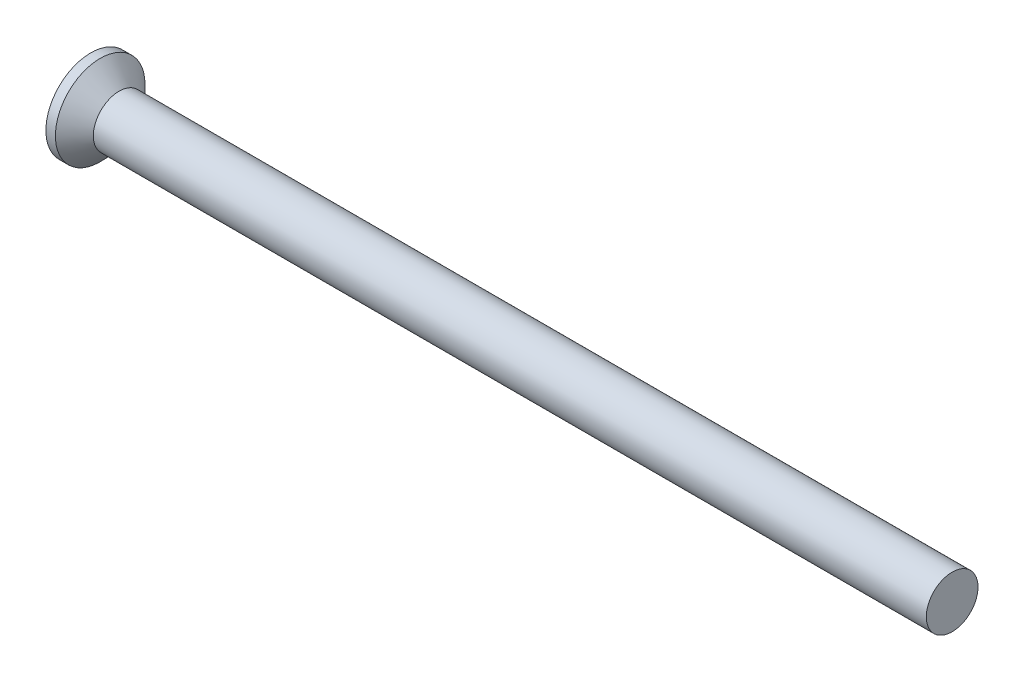
ISO-10303-21;
HEADER;
FILE_DESCRIPTION(('STEP AP214'),'2;1');
FILE_NAME('part.step','',(''),(''),'','','');
FILE_SCHEMA(('AUTOMOTIVE_DESIGN { 1 0 10303 214 1 1 1 1 }'));
ENDSEC;
DATA;
#1=APPLICATION_CONTEXT('core data for automotive mechanical design processes');
#2=APPLICATION_PROTOCOL_DEFINITION('international standard','automotive_design',2000,#1);
#3=PRODUCT_CONTEXT('',#1,'mechanical');
#4=PRODUCT('Part','Part','',(#3));
#5=PRODUCT_RELATED_PRODUCT_CATEGORY('part','',(#4));
#6=PRODUCT_DEFINITION_FORMATION('','',#4);
#7=PRODUCT_DEFINITION_CONTEXT('part definition',#1,'design');
#8=PRODUCT_DEFINITION('design','',#6,#7);
#9=PRODUCT_DEFINITION_SHAPE('','',#8);
#10=(LENGTH_UNIT() NAMED_UNIT(*) SI_UNIT(.MILLI.,.METRE.));
#11=(NAMED_UNIT(*) PLANE_ANGLE_UNIT() SI_UNIT($,.RADIAN.));
#12=(NAMED_UNIT(*) SI_UNIT($,.STERADIAN.) SOLID_ANGLE_UNIT());
#13=UNCERTAINTY_MEASURE_WITH_UNIT(LENGTH_MEASURE(1.E-05),#10,'distance_accuracy_value','');
#14=(GEOMETRIC_REPRESENTATION_CONTEXT(3) GLOBAL_UNCERTAINTY_ASSIGNED_CONTEXT((#13)) GLOBAL_UNIT_ASSIGNED_CONTEXT((#10,
#11,#12)) REPRESENTATION_CONTEXT('',''));
#15=CARTESIAN_POINT('',(0.,0.,0.));
#16=DIRECTION('',(0.,0.,1.));
#17=DIRECTION('',(1.,0.,0.));
#18=AXIS2_PLACEMENT_3D('',#15,#16,#17);
#19=CARTESIAN_POINT('',(0.,2.6,0.));
#20=DIRECTION('',(-1.,0.,0.));
#21=DIRECTION('',(0.,0.,1.));
#22=AXIS2_PLACEMENT_3D('',#19,#20,#21);
#23=PLANE('',#22);
#24=CARTESIAN_POINT('',(0.,0.,0.));
#25=DIRECTION('',(1.,0.,0.));
#26=DIRECTION('',(0.,0.,-1.));
#27=AXIS2_PLACEMENT_3D('',#24,#25,#26);
#28=CIRCLE('',#27,2.6);
#29=CARTESIAN_POINT('',(0.,0.,-2.6));
#30=VERTEX_POINT('',#29);
#31=EDGE_CURVE('E183',#30,#30,#28,.T.);
#32=ORIENTED_EDGE('',*,*,#31,.F.);
#33=EDGE_LOOP('',(#32));
#34=FACE_BOUND('',#33,.T.);
#35=DIRECTION('',(0.,1.,0.));
#36=VECTOR('',#35,1.);
#37=CARTESIAN_POINT('',(0.,-0.32,-0.32));
#38=LINE('',#37,#36);
#39=CARTESIAN_POINT('',(0.,-1.6,-0.32));
#40=VERTEX_POINT('',#39);
#41=CARTESIAN_POINT('',(0.,-0.62,-0.32));
#42=VERTEX_POINT('',#41);
#43=EDGE_CURVE('E287',#40,#42,#38,.T.);
#44=ORIENTED_EDGE('',*,*,#43,.T.);
#45=CARTESIAN_POINT('',(0.,-0.62,-0.62));
#46=DIRECTION('',(-1.,0.,0.));
#47=DIRECTION('',(0.,0.,1.));
#48=AXIS2_PLACEMENT_3D('',#45,#46,#47);
#49=CIRCLE('',#48,0.3);
#50=CARTESIAN_POINT('',(0.,-0.32,-0.62));
#51=VERTEX_POINT('',#50);
#52=EDGE_CURVE('E189',#42,#51,#49,.T.);
#53=ORIENTED_EDGE('',*,*,#52,.T.);
#54=DIRECTION('',(0.,0.,-1.));
#55=VECTOR('',#54,1.);
#56=CARTESIAN_POINT('',(0.,-0.32,-0.32));
#57=LINE('',#56,#55);
#58=CARTESIAN_POINT('',(0.,-0.32,-1.6));
#59=VERTEX_POINT('',#58);
#60=EDGE_CURVE('E282',#51,#59,#57,.T.);
#61=ORIENTED_EDGE('',*,*,#60,.T.);
#62=DIRECTION('',(0.,1.,0.));
#63=VECTOR('',#62,1.);
#64=CARTESIAN_POINT('',(0.,0.32,-1.6));
#65=LINE('',#64,#63);
#66=CARTESIAN_POINT('',(0.,0.32,-1.6));
#67=VERTEX_POINT('',#66);
#68=EDGE_CURVE('E246',#59,#67,#65,.T.);
#69=ORIENTED_EDGE('',*,*,#68,.T.);
#70=DIRECTION('',(0.,0.,1.));
#71=VECTOR('',#70,1.);
#72=CARTESIAN_POINT('',(0.,0.32,-0.32));
#73=LINE('',#72,#71);
#74=CARTESIAN_POINT('',(0.,0.32,-0.62));
#75=VERTEX_POINT('',#74);
#76=EDGE_CURVE('E236',#67,#75,#73,.T.);
#77=ORIENTED_EDGE('',*,*,#76,.T.);
#78=CARTESIAN_POINT('',(0.,0.62,-0.62));
#79=DIRECTION('',(-1.,0.,0.));
#80=DIRECTION('',(0.,0.,1.));
#81=AXIS2_PLACEMENT_3D('',#78,#79,#80);
#82=CIRCLE('',#81,0.3);
#83=CARTESIAN_POINT('',(0.,0.62,-0.32));
#84=VERTEX_POINT('',#83);
#85=EDGE_CURVE('E185',#75,#84,#82,.T.);
#86=ORIENTED_EDGE('',*,*,#85,.T.);
#87=DIRECTION('',(0.,1.,0.));
#88=VECTOR('',#87,1.);
#89=CARTESIAN_POINT('',(0.,0.32,-0.32));
#90=LINE('',#89,#88);
#91=CARTESIAN_POINT('',(0.,1.6,-0.32));
#92=VERTEX_POINT('',#91);
#93=EDGE_CURVE('E233',#84,#92,#90,.T.);
#94=ORIENTED_EDGE('',*,*,#93,.T.);
#95=DIRECTION('',(0.,0.,1.));
#96=VECTOR('',#95,1.);
#97=CARTESIAN_POINT('',(0.,1.6,-0.32));
#98=LINE('',#97,#96);
#99=CARTESIAN_POINT('',(0.,1.6,0.32));
#100=VERTEX_POINT('',#99);
#101=EDGE_CURVE('E242',#92,#100,#98,.T.);
#102=ORIENTED_EDGE('',*,*,#101,.T.);
#103=DIRECTION('',(0.,-1.,0.));
#104=VECTOR('',#103,1.);
#105=CARTESIAN_POINT('',(0.,0.32,0.32));
#106=LINE('',#105,#104);
#107=CARTESIAN_POINT('',(0.,0.62,0.32));
#108=VERTEX_POINT('',#107);
#109=EDGE_CURVE('E244',#100,#108,#106,.T.);
#110=ORIENTED_EDGE('',*,*,#109,.T.);
#111=CARTESIAN_POINT('',(0.,0.62,0.62));
#112=DIRECTION('',(-1.,0.,0.));
#113=DIRECTION('',(0.,0.,1.));
#114=AXIS2_PLACEMENT_3D('',#111,#112,#113);
#115=CIRCLE('',#114,0.3);
#116=CARTESIAN_POINT('',(0.,0.32,0.62));
#117=VERTEX_POINT('',#116);
#118=EDGE_CURVE('E155',#108,#117,#115,.T.);
#119=ORIENTED_EDGE('',*,*,#118,.T.);
#120=DIRECTION('',(0.,0.,1.));
#121=VECTOR('',#120,1.);
#122=CARTESIAN_POINT('',(0.,0.32,0.32));
#123=LINE('',#122,#121);
#124=CARTESIAN_POINT('',(0.,0.32,1.6));
#125=VERTEX_POINT('',#124);
#126=EDGE_CURVE('E149',#117,#125,#123,.T.);
#127=ORIENTED_EDGE('',*,*,#126,.T.);
#128=DIRECTION('',(0.,-1.,0.));
#129=VECTOR('',#128,1.);
#130=CARTESIAN_POINT('',(0.,0.32,1.6));
#131=LINE('',#130,#129);
#132=CARTESIAN_POINT('',(0.,-0.32,1.6));
#133=VERTEX_POINT('',#132);
#134=EDGE_CURVE('E153',#125,#133,#131,.T.);
#135=ORIENTED_EDGE('',*,*,#134,.T.);
#136=DIRECTION('',(0.,0.,-1.));
#137=VECTOR('',#136,1.);
#138=CARTESIAN_POINT('',(0.,-0.32,0.32));
#139=LINE('',#138,#137);
#140=CARTESIAN_POINT('',(0.,-0.32,0.62));
#141=VERTEX_POINT('',#140);
#142=EDGE_CURVE('E165',#133,#141,#139,.T.);
#143=ORIENTED_EDGE('',*,*,#142,.T.);
#144=CARTESIAN_POINT('',(0.,-0.62,0.62));
#145=DIRECTION('',(-1.,0.,0.));
#146=DIRECTION('',(0.,0.,1.));
#147=AXIS2_PLACEMENT_3D('',#144,#145,#146);
#148=CIRCLE('',#147,0.3);
#149=CARTESIAN_POINT('',(0.,-0.62,0.32));
#150=VERTEX_POINT('',#149);
#151=EDGE_CURVE('E187',#141,#150,#148,.T.);
#152=ORIENTED_EDGE('',*,*,#151,.T.);
#153=DIRECTION('',(0.,-1.,0.));
#154=VECTOR('',#153,1.);
#155=CARTESIAN_POINT('',(0.,-0.32,0.32));
#156=LINE('',#155,#154);
#157=CARTESIAN_POINT('',(0.,-1.6,0.319999999999999));
#158=VERTEX_POINT('',#157);
#159=EDGE_CURVE('E294',#150,#158,#156,.T.);
#160=ORIENTED_EDGE('',*,*,#159,.T.);
#161=DIRECTION('',(0.,0.,-1.));
#162=VECTOR('',#161,1.);
#163=CARTESIAN_POINT('',(0.,-1.6,-0.32));
#164=LINE('',#163,#162);
#165=EDGE_CURVE('E291',#158,#40,#164,.T.);
#166=ORIENTED_EDGE('',*,*,#165,.T.);
#167=EDGE_LOOP('',(#44,#53,#61,#69,#77,#86,#94,#102,#110,#119,#127,#135,#143,#152,#160,#166));
#168=FACE_BOUND('',#167,.T.);
#169=ADVANCED_FACE('F37',(#34,#168),#23,.T.);
#170=CARTESIAN_POINT('',(50.,1.50000000000001,0.));
#171=DIRECTION('',(1.,0.,0.));
#172=DIRECTION('',(0.,0.,-1.));
#173=AXIS2_PLACEMENT_3D('',#170,#171,#172);
#174=PLANE('',#173);
#175=CARTESIAN_POINT('',(50.,0.,0.));
#176=DIRECTION('',(1.,0.,0.));
#177=DIRECTION('',(0.,0.,-1.));
#178=AXIS2_PLACEMENT_3D('',#175,#176,#177);
#179=CIRCLE('',#178,1.50000000000001);
#180=CARTESIAN_POINT('',(50.,0.,-1.50000000000001));
#181=VERTEX_POINT('',#180);
#182=EDGE_CURVE('E170',#181,#181,#179,.T.);
#183=ORIENTED_EDGE('',*,*,#182,.T.);
#184=EDGE_LOOP('',(#183));
#185=FACE_BOUND('',#184,.T.);
#186=ADVANCED_FACE('F343',(#185),#174,.T.);
#187=CARTESIAN_POINT('',(4.51581291088132,0.,0.));
#188=DIRECTION('',(1.,0.,0.));
#189=DIRECTION('',(0.,0.,-1.));
#190=AXIS2_PLACEMENT_3D('',#187,#188,#189);
#191=CYLINDRICAL_SURFACE('',#190,2.6);
#192=ORIENTED_EDGE('',*,*,#31,.T.);
#193=EDGE_LOOP('',(#192));
#194=FACE_BOUND('',#193,.T.);
#195=CARTESIAN_POINT('',(0.550000000000004,0.,0.));
#196=DIRECTION('',(1.,0.,0.));
#197=DIRECTION('',(0.,0.,-1.));
#198=AXIS2_PLACEMENT_3D('',#195,#196,#197);
#199=CIRCLE('',#198,2.6);
#200=CARTESIAN_POINT('',(0.550000000000004,0.,-2.6));
#201=VERTEX_POINT('',#200);
#202=EDGE_CURVE('E253',#201,#201,#199,.T.);
#203=ORIENTED_EDGE('',*,*,#202,.F.);
#204=EDGE_LOOP('',(#203));
#205=FACE_BOUND('',#204,.T.);
#206=ADVANCED_FACE('F349',(#194,#205),#191,.T.);
#207=CARTESIAN_POINT('',(1.65,0.,0.));
#208=DIRECTION('',(-1.,0.,0.));
#209=DIRECTION('',(0.,0.,1.));
#210=AXIS2_PLACEMENT_3D('',#207,#208,#209);
#211=CONICAL_SURFACE('',#210,1.5,0.78539816339745);
#212=ORIENTED_EDGE('',*,*,#202,.T.);
#213=EDGE_LOOP('',(#212));
#214=FACE_BOUND('',#213,.T.);
#215=CARTESIAN_POINT('',(1.65,0.,0.));
#216=DIRECTION('',(1.,0.,0.));
#217=DIRECTION('',(0.,0.,-1.));
#218=AXIS2_PLACEMENT_3D('',#215,#216,#217);
#219=CIRCLE('',#218,1.5);
#220=CARTESIAN_POINT('',(1.65,0.,-1.5));
#221=VERTEX_POINT('',#220);
#222=EDGE_CURVE('E173',#221,#221,#219,.T.);
#223=ORIENTED_EDGE('',*,*,#222,.F.);
#224=EDGE_LOOP('',(#223));
#225=FACE_BOUND('',#224,.T.);
#226=ADVANCED_FACE('F489',(#214,#225),#211,.T.);
#227=CARTESIAN_POINT('',(4.51581291088132,0.,0.));
#228=DIRECTION('',(1.,0.,0.));
#229=DIRECTION('',(0.,0.,-1.));
#230=AXIS2_PLACEMENT_3D('',#227,#228,#229);
#231=CYLINDRICAL_SURFACE('',#230,1.5);
#232=ORIENTED_EDGE('',*,*,#182,.F.);
#233=EDGE_LOOP('',(#232));
#234=FACE_BOUND('',#233,.T.);
#235=ORIENTED_EDGE('',*,*,#222,.T.);
#236=EDGE_LOOP('',(#235));
#237=FACE_BOUND('',#236,.T.);
#238=ADVANCED_FACE('F459',(#234,#237),#231,.T.);
#239=CARTESIAN_POINT('',(0.825,0.32,0.32));
#240=DIRECTION('',(0.,-1.,0.));
#241=DIRECTION('',(0.,0.,-1.));
#242=AXIS2_PLACEMENT_3D('',#239,#240,#241);
#243=PLANE('',#242);
#244=ORIENTED_EDGE('',*,*,#126,.F.);
#245=DIRECTION('',(-1.,0.,0.));
#246=VECTOR('',#245,1.);
#247=CARTESIAN_POINT('',(0.825,0.32,0.62));
#248=LINE('',#247,#246);
#249=CARTESIAN_POINT('',(0.825,0.32,0.62));
#250=VERTEX_POINT('',#249);
#251=EDGE_CURVE('E52',#117,#250,#248,.F.);
#252=ORIENTED_EDGE('',*,*,#251,.T.);
#253=DIRECTION('',(0.,0.,1.));
#254=VECTOR('',#253,1.);
#255=CARTESIAN_POINT('',(0.825,0.32,0.32));
#256=LINE('',#255,#254);
#257=CARTESIAN_POINT('',(0.825,0.32,1.12368602791856));
#258=VERTEX_POINT('',#257);
#259=EDGE_CURVE('E168',#250,#258,#256,.T.);
#260=ORIENTED_EDGE('',*,*,#259,.T.);
#261=DIRECTION('',(-0.866025403784438,0.,0.500000000000001));
#262=VECTOR('',#261,1.);
#263=CARTESIAN_POINT('',(0.,0.32,1.6));
#264=LINE('',#263,#262);
#265=EDGE_CURVE('E161',#258,#125,#264,.T.);
#266=ORIENTED_EDGE('',*,*,#265,.T.);
#267=EDGE_LOOP('',(#244,#252,#260,#266));
#268=FACE_BOUND('',#267,.T.);
#269=ADVANCED_FACE('F167',(#268),#243,.T.);
#270=CARTESIAN_POINT('',(0.,0.32,1.6));
#271=DIRECTION('',(-0.500000000000001,0.,-0.866025403784438));
#272=DIRECTION('',(-0.866025403784438,0.,0.500000000000001));
#273=AXIS2_PLACEMENT_3D('',#270,#271,#272);
#274=PLANE('',#273);
#275=ORIENTED_EDGE('',*,*,#134,.F.);
#276=ORIENTED_EDGE('',*,*,#265,.F.);
#277=DIRECTION('',(0.,-1.,0.));
#278=VECTOR('',#277,1.);
#279=CARTESIAN_POINT('',(0.825,0.32,1.12368602791856));
#280=LINE('',#279,#278);
#281=CARTESIAN_POINT('',(0.825,-0.32,1.12368602791856));
#282=VERTEX_POINT('',#281);
#283=EDGE_CURVE('E179',#258,#282,#280,.T.);
#284=ORIENTED_EDGE('',*,*,#283,.T.);
#285=DIRECTION('',(-0.866025403784438,0.,0.500000000000001));
#286=VECTOR('',#285,1.);
#287=CARTESIAN_POINT('',(1.17300625842204,-0.32,0.922764520938917));
#288=LINE('',#287,#286);
#289=EDGE_CURVE('E163',#282,#133,#288,.T.);
#290=ORIENTED_EDGE('',*,*,#289,.T.);
#291=EDGE_LOOP('',(#275,#276,#284,#290));
#292=FACE_BOUND('',#291,.T.);
#293=ADVANCED_FACE('F160',(#292),#274,.T.);
#294=CARTESIAN_POINT('',(0.825,-0.32,0.32));
#295=DIRECTION('',(0.,1.,0.));
#296=DIRECTION('',(0.,0.,1.));
#297=AXIS2_PLACEMENT_3D('',#294,#295,#296);
#298=PLANE('',#297);
#299=DIRECTION('',(0.,0.,-1.));
#300=VECTOR('',#299,1.);
#301=CARTESIAN_POINT('',(0.825,-0.32,0.32));
#302=LINE('',#301,#300);
#303=CARTESIAN_POINT('',(0.825,-0.32,0.62));
#304=VERTEX_POINT('',#303);
#305=EDGE_CURVE('E303',#282,#304,#302,.T.);
#306=ORIENTED_EDGE('',*,*,#305,.T.);
#307=DIRECTION('',(-1.,0.,0.));
#308=VECTOR('',#307,1.);
#309=CARTESIAN_POINT('',(0.825,-0.32,0.62));
#310=LINE('',#309,#308);
#311=EDGE_CURVE('E193',#304,#141,#310,.T.);
#312=ORIENTED_EDGE('',*,*,#311,.T.);
#313=ORIENTED_EDGE('',*,*,#142,.F.);
#314=ORIENTED_EDGE('',*,*,#289,.F.);
#315=EDGE_LOOP('',(#306,#312,#313,#314));
#316=FACE_BOUND('',#315,.T.);
#317=ADVANCED_FACE('F308',(#316),#298,.T.);
#318=CARTESIAN_POINT('',(0.825,-0.32,0.32));
#319=DIRECTION('',(0.,0.,-1.));
#320=DIRECTION('',(0.,1.,0.));
#321=AXIS2_PLACEMENT_3D('',#318,#319,#320);
#322=PLANE('',#321);
#323=ORIENTED_EDGE('',*,*,#159,.F.);
#324=DIRECTION('',(-1.,0.,0.));
#325=VECTOR('',#324,1.);
#326=CARTESIAN_POINT('',(0.825,-0.62,0.32));
#327=LINE('',#326,#325);
#328=CARTESIAN_POINT('',(0.825,-0.62,0.32));
#329=VERTEX_POINT('',#328);
#330=EDGE_CURVE('E196',#150,#329,#327,.F.);
#331=ORIENTED_EDGE('',*,*,#330,.T.);
#332=DIRECTION('',(0.,-1.,0.));
#333=VECTOR('',#332,1.);
#334=CARTESIAN_POINT('',(0.825,-0.32,0.32));
#335=LINE('',#334,#333);
#336=CARTESIAN_POINT('',(0.825,-1.12368602791856,0.32));
#337=VERTEX_POINT('',#336);
#338=EDGE_CURVE('E264',#329,#337,#335,.T.);
#339=ORIENTED_EDGE('',*,*,#338,.T.);
#340=DIRECTION('',(-0.866025403784438,-0.500000000000001,0.));
#341=VECTOR('',#340,1.);
#342=CARTESIAN_POINT('',(0.,-1.6,0.319999999999999));
#343=LINE('',#342,#341);
#344=EDGE_CURVE('E175',#337,#158,#343,.T.);
#345=ORIENTED_EDGE('',*,*,#344,.T.);
#346=EDGE_LOOP('',(#323,#331,#339,#345));
#347=FACE_BOUND('',#346,.T.);
#348=ADVANCED_FACE('F318',(#347),#322,.T.);
#349=CARTESIAN_POINT('',(0.,-1.6,-0.32));
#350=DIRECTION('',(-0.500000000000001,0.866025403784438,0.));
#351=DIRECTION('',(-0.866025403784438,-0.500000000000001,0.));
#352=AXIS2_PLACEMENT_3D('',#349,#350,#351);
#353=PLANE('',#352);
#354=ORIENTED_EDGE('',*,*,#165,.F.);
#355=ORIENTED_EDGE('',*,*,#344,.F.);
#356=DIRECTION('',(0.,0.,-1.));
#357=VECTOR('',#356,1.);
#358=CARTESIAN_POINT('',(0.825,-1.12368602791856,-0.32));
#359=LINE('',#358,#357);
#360=CARTESIAN_POINT('',(0.825,-1.12368602791856,-0.32));
#361=VERTEX_POINT('',#360);
#362=EDGE_CURVE('E261',#337,#361,#359,.T.);
#363=ORIENTED_EDGE('',*,*,#362,.T.);
#364=DIRECTION('',(-0.866025403784438,-0.500000000000001,0.));
#365=VECTOR('',#364,1.);
#366=CARTESIAN_POINT('',(1.17300625842204,-0.922764520938918,-0.32));
#367=LINE('',#366,#365);
#368=EDGE_CURVE('E258',#361,#40,#367,.T.);
#369=ORIENTED_EDGE('',*,*,#368,.T.);
#370=EDGE_LOOP('',(#354,#355,#363,#369));
#371=FACE_BOUND('',#370,.T.);
#372=ADVANCED_FACE('F322',(#371),#353,.T.);
#373=CARTESIAN_POINT('',(0.825,-0.32,-0.32));
#374=DIRECTION('',(0.,0.,1.));
#375=DIRECTION('',(1.,0.,0.));
#376=AXIS2_PLACEMENT_3D('',#373,#374,#375);
#377=PLANE('',#376);
#378=DIRECTION('',(0.,1.,0.));
#379=VECTOR('',#378,1.);
#380=CARTESIAN_POINT('',(0.825,-0.32,-0.32));
#381=LINE('',#380,#379);
#382=CARTESIAN_POINT('',(0.825,-0.62,-0.32));
#383=VERTEX_POINT('',#382);
#384=EDGE_CURVE('E263',#361,#383,#381,.T.);
#385=ORIENTED_EDGE('',*,*,#384,.T.);
#386=DIRECTION('',(-1.,0.,0.));
#387=VECTOR('',#386,1.);
#388=CARTESIAN_POINT('',(0.825,-0.62,-0.32));
#389=LINE('',#388,#387);
#390=EDGE_CURVE('E180',#383,#42,#389,.T.);
#391=ORIENTED_EDGE('',*,*,#390,.T.);
#392=ORIENTED_EDGE('',*,*,#43,.F.);
#393=ORIENTED_EDGE('',*,*,#368,.F.);
#394=EDGE_LOOP('',(#385,#391,#392,#393));
#395=FACE_BOUND('',#394,.T.);
#396=ADVANCED_FACE('F326',(#395),#377,.T.);
#397=CARTESIAN_POINT('',(0.825,-0.32,-0.32));
#398=DIRECTION('',(0.,1.,0.));
#399=DIRECTION('',(0.,0.,1.));
#400=AXIS2_PLACEMENT_3D('',#397,#398,#399);
#401=PLANE('',#400);
#402=ORIENTED_EDGE('',*,*,#60,.F.);
#403=DIRECTION('',(-1.,0.,0.));
#404=VECTOR('',#403,1.);
#405=CARTESIAN_POINT('',(0.825,-0.32,-0.62));
#406=LINE('',#405,#404);
#407=CARTESIAN_POINT('',(0.825,-0.32,-0.62));
#408=VERTEX_POINT('',#407);
#409=EDGE_CURVE('E191',#51,#408,#406,.F.);
#410=ORIENTED_EDGE('',*,*,#409,.T.);
#411=DIRECTION('',(0.,0.,-1.));
#412=VECTOR('',#411,1.);
#413=CARTESIAN_POINT('',(0.825,-0.32,-0.32));
#414=LINE('',#413,#412);
#415=CARTESIAN_POINT('',(0.825,-0.32,-1.12368602791856));
#416=VERTEX_POINT('',#415);
#417=EDGE_CURVE('E275',#408,#416,#414,.T.);
#418=ORIENTED_EDGE('',*,*,#417,.T.);
#419=DIRECTION('',(-0.866025403784438,0.,-0.500000000000001));
#420=VECTOR('',#419,1.);
#421=CARTESIAN_POINT('',(0.,-0.32,-1.6));
#422=LINE('',#421,#420);
#423=EDGE_CURVE('E260',#416,#59,#422,.T.);
#424=ORIENTED_EDGE('',*,*,#423,.T.);
#425=EDGE_LOOP('',(#402,#410,#418,#424));
#426=FACE_BOUND('',#425,.T.);
#427=ADVANCED_FACE('F281',(#426),#401,.T.);
#428=CARTESIAN_POINT('',(0.,0.32,-1.6));
#429=DIRECTION('',(-0.500000000000001,0.,0.866025403784438));
#430=DIRECTION('',(0.866025403784438,0.,0.500000000000001));
#431=AXIS2_PLACEMENT_3D('',#428,#429,#430);
#432=PLANE('',#431);
#433=ORIENTED_EDGE('',*,*,#68,.F.);
#434=ORIENTED_EDGE('',*,*,#423,.F.);
#435=DIRECTION('',(0.,1.,0.));
#436=VECTOR('',#435,1.);
#437=CARTESIAN_POINT('',(0.825,0.32,-1.12368602791856));
#438=LINE('',#437,#436);
#439=CARTESIAN_POINT('',(0.825,0.32,-1.12368602791856));
#440=VERTEX_POINT('',#439);
#441=EDGE_CURVE('E228',#416,#440,#438,.T.);
#442=ORIENTED_EDGE('',*,*,#441,.T.);
#443=DIRECTION('',(-0.866025403784438,0.,-0.500000000000001));
#444=VECTOR('',#443,1.);
#445=CARTESIAN_POINT('',(1.17300625842204,0.32,-0.922764520938918));
#446=LINE('',#445,#444);
#447=EDGE_CURVE('E227',#440,#67,#446,.T.);
#448=ORIENTED_EDGE('',*,*,#447,.T.);
#449=EDGE_LOOP('',(#433,#434,#442,#448));
#450=FACE_BOUND('',#449,.T.);
#451=ADVANCED_FACE('F286',(#450),#432,.T.);
#452=CARTESIAN_POINT('',(0.825,0.32,-0.32));
#453=DIRECTION('',(0.,-1.,0.));
#454=DIRECTION('',(0.,0.,-1.));
#455=AXIS2_PLACEMENT_3D('',#452,#453,#454);
#456=PLANE('',#455);
#457=DIRECTION('',(0.,0.,1.));
#458=VECTOR('',#457,1.);
#459=CARTESIAN_POINT('',(0.825,0.32,-0.32));
#460=LINE('',#459,#458);
#461=CARTESIAN_POINT('',(0.825,0.32,-0.62));
#462=VERTEX_POINT('',#461);
#463=EDGE_CURVE('E216',#440,#462,#460,.T.);
#464=ORIENTED_EDGE('',*,*,#463,.T.);
#465=DIRECTION('',(-1.,0.,0.));
#466=VECTOR('',#465,1.);
#467=CARTESIAN_POINT('',(0.825,0.32,-0.62));
#468=LINE('',#467,#466);
#469=EDGE_CURVE('E198',#462,#75,#468,.T.);
#470=ORIENTED_EDGE('',*,*,#469,.T.);
#471=ORIENTED_EDGE('',*,*,#76,.F.);
#472=ORIENTED_EDGE('',*,*,#447,.F.);
#473=EDGE_LOOP('',(#464,#470,#471,#472));
#474=FACE_BOUND('',#473,.T.);
#475=ADVANCED_FACE('F224',(#474),#456,.T.);
#476=CARTESIAN_POINT('',(0.825,0.32,-0.32));
#477=DIRECTION('',(0.,0.,1.));
#478=DIRECTION('',(1.,0.,0.));
#479=AXIS2_PLACEMENT_3D('',#476,#477,#478);
#480=PLANE('',#479);
#481=ORIENTED_EDGE('',*,*,#93,.F.);
#482=DIRECTION('',(-1.,0.,0.));
#483=VECTOR('',#482,1.);
#484=CARTESIAN_POINT('',(0.825,0.62,-0.32));
#485=LINE('',#484,#483);
#486=CARTESIAN_POINT('',(0.825,0.62,-0.32));
#487=VERTEX_POINT('',#486);
#488=EDGE_CURVE('E201',#84,#487,#485,.F.);
#489=ORIENTED_EDGE('',*,*,#488,.T.);
#490=DIRECTION('',(0.,1.,0.));
#491=VECTOR('',#490,1.);
#492=CARTESIAN_POINT('',(0.825,0.32,-0.32));
#493=LINE('',#492,#491);
#494=CARTESIAN_POINT('',(0.825,1.12368602791856,-0.32));
#495=VERTEX_POINT('',#494);
#496=EDGE_CURVE('E218',#487,#495,#493,.T.);
#497=ORIENTED_EDGE('',*,*,#496,.T.);
#498=DIRECTION('',(-0.866025403784438,0.500000000000001,0.));
#499=VECTOR('',#498,1.);
#500=CARTESIAN_POINT('',(0.,1.6,-0.32));
#501=LINE('',#500,#499);
#502=EDGE_CURVE('E240',#495,#92,#501,.T.);
#503=ORIENTED_EDGE('',*,*,#502,.T.);
#504=EDGE_LOOP('',(#481,#489,#497,#503));
#505=FACE_BOUND('',#504,.T.);
#506=ADVANCED_FACE('F238',(#505),#480,.T.);
#507=CARTESIAN_POINT('',(0.,1.6,-0.32));
#508=DIRECTION('',(-0.500000000000001,-0.866025403784438,0.));
#509=DIRECTION('',(0.866025403784438,-0.500000000000001,0.));
#510=AXIS2_PLACEMENT_3D('',#507,#508,#509);
#511=PLANE('',#510);
#512=ORIENTED_EDGE('',*,*,#101,.F.);
#513=ORIENTED_EDGE('',*,*,#502,.F.);
#514=DIRECTION('',(0.,0.,1.));
#515=VECTOR('',#514,1.);
#516=CARTESIAN_POINT('',(0.825,1.12368602791856,-0.32));
#517=LINE('',#516,#515);
#518=CARTESIAN_POINT('',(0.825,1.12368602791856,0.32));
#519=VERTEX_POINT('',#518);
#520=EDGE_CURVE('E270',#495,#519,#517,.T.);
#521=ORIENTED_EDGE('',*,*,#520,.T.);
#522=DIRECTION('',(-0.866025403784438,0.500000000000001,0.));
#523=VECTOR('',#522,1.);
#524=CARTESIAN_POINT('',(1.17300625842204,0.922764520938918,0.32));
#525=LINE('',#524,#523);
#526=EDGE_CURVE('E267',#519,#100,#525,.T.);
#527=ORIENTED_EDGE('',*,*,#526,.T.);
#528=EDGE_LOOP('',(#512,#513,#521,#527));
#529=FACE_BOUND('',#528,.T.);
#530=ADVANCED_FACE('F361',(#529),#511,.T.);
#531=CARTESIAN_POINT('',(0.825,0.32,0.32));
#532=DIRECTION('',(0.,0.,-1.));
#533=DIRECTION('',(0.,1.,0.));
#534=AXIS2_PLACEMENT_3D('',#531,#532,#533);
#535=PLANE('',#534);
#536=DIRECTION('',(0.,-1.,0.));
#537=VECTOR('',#536,1.);
#538=CARTESIAN_POINT('',(0.825,0.32,0.32));
#539=LINE('',#538,#537);
#540=CARTESIAN_POINT('',(0.825,0.62,0.32));
#541=VERTEX_POINT('',#540);
#542=EDGE_CURVE('E269',#519,#541,#539,.T.);
#543=ORIENTED_EDGE('',*,*,#542,.T.);
#544=DIRECTION('',(-1.,0.,0.));
#545=VECTOR('',#544,1.);
#546=CARTESIAN_POINT('',(0.825,0.62,0.32));
#547=LINE('',#546,#545);
#548=EDGE_CURVE('E203',#541,#108,#547,.T.);
#549=ORIENTED_EDGE('',*,*,#548,.T.);
#550=ORIENTED_EDGE('',*,*,#109,.F.);
#551=ORIENTED_EDGE('',*,*,#526,.F.);
#552=EDGE_LOOP('',(#543,#549,#550,#551));
#553=FACE_BOUND('',#552,.T.);
#554=ADVANCED_FACE('F339',(#553),#535,.T.);
#555=CARTESIAN_POINT('',(0.825,0.32,0.32));
#556=DIRECTION('',(1.,0.,0.));
#557=DIRECTION('',(0.,0.,-1.));
#558=AXIS2_PLACEMENT_3D('',#555,#556,#557);
#559=PLANE('',#558);
#560=ORIENTED_EDGE('',*,*,#259,.F.);
#561=CARTESIAN_POINT('',(0.825,0.62,0.62));
#562=DIRECTION('',(1.,0.,0.));
#563=DIRECTION('',(0.,0.,-1.));
#564=AXIS2_PLACEMENT_3D('',#561,#562,#563);
#565=CIRCLE('',#564,0.3);
#566=EDGE_CURVE('E11',#250,#541,#565,.T.);
#567=ORIENTED_EDGE('',*,*,#566,.T.);
#568=ORIENTED_EDGE('',*,*,#542,.F.);
#569=ORIENTED_EDGE('',*,*,#520,.F.);
#570=ORIENTED_EDGE('',*,*,#496,.F.);
#571=CARTESIAN_POINT('',(0.825,0.62,-0.62));
#572=DIRECTION('',(1.,0.,0.));
#573=DIRECTION('',(0.,0.,-1.));
#574=AXIS2_PLACEMENT_3D('',#571,#572,#573);
#575=CIRCLE('',#574,0.3);
#576=EDGE_CURVE('E45',#487,#462,#575,.T.);
#577=ORIENTED_EDGE('',*,*,#576,.T.);
#578=ORIENTED_EDGE('',*,*,#463,.F.);
#579=ORIENTED_EDGE('',*,*,#441,.F.);
#580=ORIENTED_EDGE('',*,*,#417,.F.);
#581=CARTESIAN_POINT('',(0.825,-0.62,-0.62));
#582=DIRECTION('',(1.,0.,0.));
#583=DIRECTION('',(0.,0.,-1.));
#584=AXIS2_PLACEMENT_3D('',#581,#582,#583);
#585=CIRCLE('',#584,0.3);
#586=EDGE_CURVE('E207',#408,#383,#585,.T.);
#587=ORIENTED_EDGE('',*,*,#586,.T.);
#588=ORIENTED_EDGE('',*,*,#384,.F.);
#589=ORIENTED_EDGE('',*,*,#362,.F.);
#590=ORIENTED_EDGE('',*,*,#338,.F.);
#591=CARTESIAN_POINT('',(0.825,-0.62,0.62));
#592=DIRECTION('',(1.,0.,0.));
#593=DIRECTION('',(0.,0.,-1.));
#594=AXIS2_PLACEMENT_3D('',#591,#592,#593);
#595=CIRCLE('',#594,0.3);
#596=EDGE_CURVE('E209',#329,#304,#595,.T.);
#597=ORIENTED_EDGE('',*,*,#596,.T.);
#598=ORIENTED_EDGE('',*,*,#305,.F.);
#599=ORIENTED_EDGE('',*,*,#283,.F.);
#600=EDGE_LOOP('',(#560,#567,#568,#569,#570,#577,#578,#579,#580,#587,#588,#589,#590,#597,#598,#599));
#601=FACE_BOUND('',#600,.T.);
#602=ADVANCED_FACE('F214',(#601),#559,.F.);
#603=CARTESIAN_POINT('',(0.825,-0.62,-0.62));
#604=DIRECTION('',(-1.,0.,0.));
#605=DIRECTION('',(0.,0.,1.));
#606=AXIS2_PLACEMENT_3D('',#603,#604,#605);
#607=CYLINDRICAL_SURFACE('',#606,0.3);
#608=ORIENTED_EDGE('',*,*,#586,.F.);
#609=ORIENTED_EDGE('',*,*,#409,.F.);
#610=ORIENTED_EDGE('',*,*,#52,.F.);
#611=ORIENTED_EDGE('',*,*,#390,.F.);
#612=EDGE_LOOP('',(#608,#609,#610,#611));
#613=FACE_BOUND('',#612,.T.);
#614=ADVANCED_FACE('F331',(#613),#607,.T.);
#615=CARTESIAN_POINT('',(0.825,-0.62,0.62));
#616=DIRECTION('',(-1.,0.,0.));
#617=DIRECTION('',(0.,0.,1.));
#618=AXIS2_PLACEMENT_3D('',#615,#616,#617);
#619=CYLINDRICAL_SURFACE('',#618,0.3);
#620=ORIENTED_EDGE('',*,*,#596,.F.);
#621=ORIENTED_EDGE('',*,*,#330,.F.);
#622=ORIENTED_EDGE('',*,*,#151,.F.);
#623=ORIENTED_EDGE('',*,*,#311,.F.);
#624=EDGE_LOOP('',(#620,#621,#622,#623));
#625=FACE_BOUND('',#624,.T.);
#626=ADVANCED_FACE('F315',(#625),#619,.T.);
#627=CARTESIAN_POINT('',(0.825,0.62,-0.62));
#628=DIRECTION('',(-1.,0.,0.));
#629=DIRECTION('',(0.,0.,1.));
#630=AXIS2_PLACEMENT_3D('',#627,#628,#629);
#631=CYLINDRICAL_SURFACE('',#630,0.3);
#632=ORIENTED_EDGE('',*,*,#576,.F.);
#633=ORIENTED_EDGE('',*,*,#488,.F.);
#634=ORIENTED_EDGE('',*,*,#85,.F.);
#635=ORIENTED_EDGE('',*,*,#469,.F.);
#636=EDGE_LOOP('',(#632,#633,#634,#635));
#637=FACE_BOUND('',#636,.T.);
#638=ADVANCED_FACE('F230',(#637),#631,.T.);
#639=CARTESIAN_POINT('',(0.825,0.62,0.62));
#640=DIRECTION('',(-1.,0.,0.));
#641=DIRECTION('',(0.,0.,1.));
#642=AXIS2_PLACEMENT_3D('',#639,#640,#641);
#643=CYLINDRICAL_SURFACE('',#642,0.3);
#644=ORIENTED_EDGE('',*,*,#566,.F.);
#645=ORIENTED_EDGE('',*,*,#251,.F.);
#646=ORIENTED_EDGE('',*,*,#118,.F.);
#647=ORIENTED_EDGE('',*,*,#548,.F.);
#648=EDGE_LOOP('',(#644,#645,#646,#647));
#649=FACE_BOUND('',#648,.T.);
#650=ADVANCED_FACE('F39',(#649),#643,.T.);
#651=CLOSED_SHELL('',(#169,#186,#206,#226,#238,#269,#293,#317,#348,#372,#396,#427,#451,#475,
#506,#530,#554,#602,#614,#626,#638,#650));
#652=MANIFOLD_SOLID_BREP('B2',#651);
#653=ADVANCED_BREP_SHAPE_REPRESENTATION('',(#18,#652),#14);
#654=SHAPE_DEFINITION_REPRESENTATION(#9,#653);
ENDSEC;
END-ISO-10303-21;
